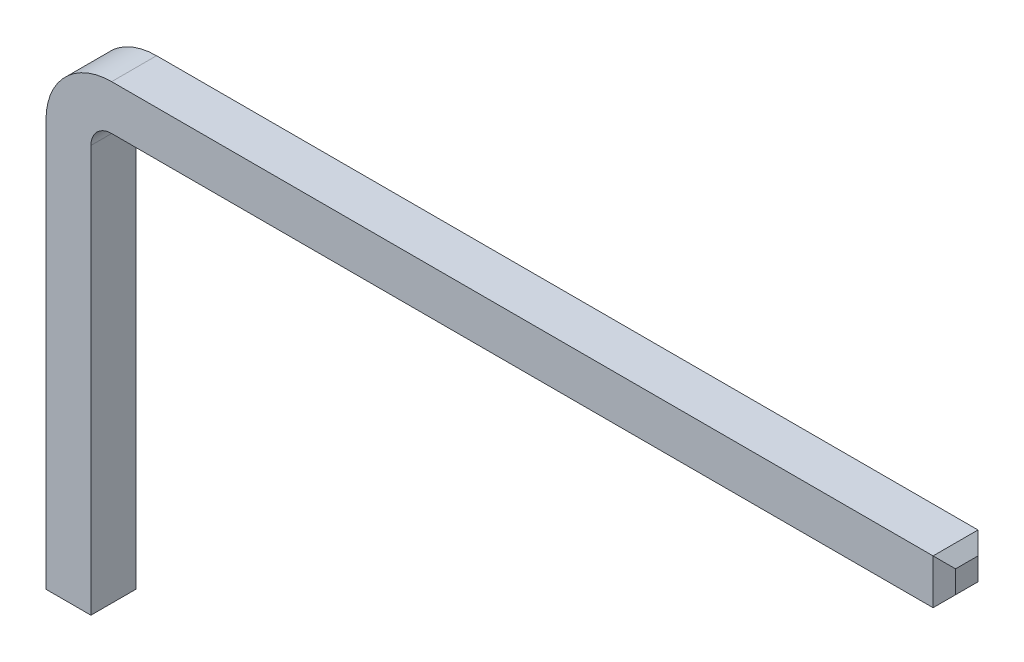
ISO-10303-21;
HEADER;
FILE_DESCRIPTION(('STEP AP214'),'2;1');
FILE_NAME('part.step','',(''),(''),'','','');
FILE_SCHEMA(('AUTOMOTIVE_DESIGN { 1 0 10303 214 1 1 1 1 }'));
ENDSEC;
DATA;
#1=APPLICATION_CONTEXT('core data for automotive mechanical design processes');
#2=APPLICATION_PROTOCOL_DEFINITION('international standard','automotive_design',2000,#1);
#3=PRODUCT_CONTEXT('',#1,'mechanical');
#4=PRODUCT('Part','Part','',(#3));
#5=PRODUCT_RELATED_PRODUCT_CATEGORY('part','',(#4));
#6=PRODUCT_DEFINITION_FORMATION('','',#4);
#7=PRODUCT_DEFINITION_CONTEXT('part definition',#1,'design');
#8=PRODUCT_DEFINITION('design','',#6,#7);
#9=PRODUCT_DEFINITION_SHAPE('','',#8);
#10=(LENGTH_UNIT() NAMED_UNIT(*) SI_UNIT(.MILLI.,.METRE.));
#11=(NAMED_UNIT(*) PLANE_ANGLE_UNIT() SI_UNIT($,.RADIAN.));
#12=(NAMED_UNIT(*) SI_UNIT($,.STERADIAN.) SOLID_ANGLE_UNIT());
#13=UNCERTAINTY_MEASURE_WITH_UNIT(LENGTH_MEASURE(1.E-05),#10,'distance_accuracy_value','');
#14=(GEOMETRIC_REPRESENTATION_CONTEXT(3) GLOBAL_UNCERTAINTY_ASSIGNED_CONTEXT((#13)) GLOBAL_UNIT_ASSIGNED_CONTEXT((#10,
#11,#12)) REPRESENTATION_CONTEXT('',''));
#15=CARTESIAN_POINT('',(0.,0.,0.));
#16=DIRECTION('',(0.,0.,1.));
#17=DIRECTION('',(1.,0.,0.));
#18=AXIS2_PLACEMENT_3D('',#15,#16,#17);
#19=CARTESIAN_POINT('',(0.,0.,0.65));
#20=DIRECTION('',(0.,1.,0.));
#21=DIRECTION('',(0.,0.,1.));
#22=AXIS2_PLACEMENT_3D('',#19,#20,#21);
#23=PLANE('',#22);
#24=DIRECTION('',(0.,0.,-1.));
#25=VECTOR('',#24,1.);
#26=CARTESIAN_POINT('',(0.162500000000004,0.,0.65));
#27=LINE('',#26,#25);
#28=CARTESIAN_POINT('',(0.162500000000004,0.,0.487499999999999));
#29=VERTEX_POINT('',#28);
#30=CARTESIAN_POINT('',(0.162500000000004,0.,0.162500000000001));
#31=VERTEX_POINT('',#30);
#32=EDGE_CURVE('E180',#29,#31,#27,.T.);
#33=ORIENTED_EDGE('',*,*,#32,.T.);
#34=DIRECTION('',(1.,0.,0.));
#35=VECTOR('',#34,1.);
#36=CARTESIAN_POINT('',(0.65,0.,0.162500000000001));
#37=LINE('',#36,#35);
#38=CARTESIAN_POINT('',(0.487499999999999,0.,0.162500000000001));
#39=VERTEX_POINT('',#38);
#40=EDGE_CURVE('E182',#31,#39,#37,.T.);
#41=ORIENTED_EDGE('',*,*,#40,.T.);
#42=DIRECTION('',(0.,0.,1.));
#43=VECTOR('',#42,1.);
#44=CARTESIAN_POINT('',(0.487499999999999,0.,0.65));
#45=LINE('',#44,#43);
#46=CARTESIAN_POINT('',(0.487499999999999,0.,0.487499999999999));
#47=VERTEX_POINT('',#46);
#48=EDGE_CURVE('E138',#39,#47,#45,.T.);
#49=ORIENTED_EDGE('',*,*,#48,.T.);
#50=DIRECTION('',(-1.,0.,0.));
#51=VECTOR('',#50,1.);
#52=CARTESIAN_POINT('',(0.,0.,0.487499999999999));
#53=LINE('',#52,#51);
#54=EDGE_CURVE('E178',#47,#29,#53,.T.);
#55=ORIENTED_EDGE('',*,*,#54,.T.);
#56=EDGE_LOOP('',(#33,#41,#49,#55));
#57=FACE_BOUND('',#56,.T.);
#58=ADVANCED_FACE('F31',(#57),#23,.F.);
#59=CARTESIAN_POINT('',(0.65,0.,0.65));
#60=DIRECTION('',(-1.,0.,0.));
#61=DIRECTION('',(0.,0.,1.));
#62=AXIS2_PLACEMENT_3D('',#59,#60,#61);
#63=PLANE('',#62);
#64=DIRECTION('',(0.,1.,0.));
#65=VECTOR('',#64,1.);
#66=CARTESIAN_POINT('',(0.65,0.,0.65));
#67=LINE('',#66,#65);
#68=CARTESIAN_POINT('',(0.65,0.1625,0.65));
#69=VERTEX_POINT('',#68);
#70=CARTESIAN_POINT('',(0.65,6.04999999999998,0.65));
#71=VERTEX_POINT('',#70);
#72=EDGE_CURVE('E157',#69,#71,#67,.T.);
#73=ORIENTED_EDGE('',*,*,#72,.F.);
#74=DIRECTION('',(0.,0.,-1.));
#75=VECTOR('',#74,1.);
#76=CARTESIAN_POINT('',(0.65,0.1625,0.65));
#77=LINE('',#76,#75);
#78=CARTESIAN_POINT('',(0.65,0.1625,0.));
#79=VERTEX_POINT('',#78);
#80=EDGE_CURVE('E125',#69,#79,#77,.T.);
#81=ORIENTED_EDGE('',*,*,#80,.T.);
#82=DIRECTION('',(0.,1.,0.));
#83=VECTOR('',#82,1.);
#84=CARTESIAN_POINT('',(0.65,0.,0.));
#85=LINE('',#84,#83);
#86=CARTESIAN_POINT('',(0.65,6.04999999999998,0.));
#87=VERTEX_POINT('',#86);
#88=EDGE_CURVE('E118',#79,#87,#85,.T.);
#89=ORIENTED_EDGE('',*,*,#88,.T.);
#90=DIRECTION('',(0.,0.,-1.));
#91=VECTOR('',#90,1.);
#92=CARTESIAN_POINT('',(0.65,6.04999999999998,0.65));
#93=LINE('',#92,#91);
#94=EDGE_CURVE('E122',#71,#87,#93,.T.);
#95=ORIENTED_EDGE('',*,*,#94,.F.);
#96=EDGE_LOOP('',(#73,#81,#89,#95));
#97=FACE_BOUND('',#96,.T.);
#98=ADVANCED_FACE('F121',(#97),#63,.F.);
#99=CARTESIAN_POINT('',(0.95,6.04999999999998,0.65));
#100=DIRECTION('',(0.,0.,-1.));
#101=DIRECTION('',(-1.,0.,0.));
#102=AXIS2_PLACEMENT_3D('',#99,#100,#101);
#103=CYLINDRICAL_SURFACE('',#102,0.3);
#104=CARTESIAN_POINT('',(0.95,6.04999999999998,0.));
#105=DIRECTION('',(0.,0.,-1.));
#106=DIRECTION('',(-1.,0.,0.));
#107=AXIS2_PLACEMENT_3D('',#104,#105,#106);
#108=CIRCLE('',#107,0.3);
#109=CARTESIAN_POINT('',(0.95,6.34999999999998,0.));
#110=VERTEX_POINT('',#109);
#111=EDGE_CURVE('E130',#87,#110,#108,.T.);
#112=ORIENTED_EDGE('',*,*,#111,.T.);
#113=DIRECTION('',(0.,0.,-1.));
#114=VECTOR('',#113,1.);
#115=CARTESIAN_POINT('',(0.95,6.34999999999998,0.65));
#116=LINE('',#115,#114);
#117=CARTESIAN_POINT('',(0.95,6.34999999999998,0.65));
#118=VERTEX_POINT('',#117);
#119=EDGE_CURVE('E139',#118,#110,#116,.T.);
#120=ORIENTED_EDGE('',*,*,#119,.F.);
#121=CARTESIAN_POINT('',(0.95,6.04999999999998,0.65));
#122=DIRECTION('',(0.,0.,-1.));
#123=DIRECTION('',(-1.,0.,0.));
#124=AXIS2_PLACEMENT_3D('',#121,#122,#123);
#125=CIRCLE('',#124,0.3);
#126=EDGE_CURVE('E137',#71,#118,#125,.T.);
#127=ORIENTED_EDGE('',*,*,#126,.F.);
#128=ORIENTED_EDGE('',*,*,#94,.T.);
#129=EDGE_LOOP('',(#112,#120,#127,#128));
#130=FACE_BOUND('',#129,.T.);
#131=ADVANCED_FACE('F134',(#130),#103,.F.);
#132=CARTESIAN_POINT('',(0.95,6.34999999999998,0.65));
#133=DIRECTION('',(0.,1.,0.));
#134=DIRECTION('',(-1.,0.,0.));
#135=AXIS2_PLACEMENT_3D('',#132,#133,#134);
#136=PLANE('',#135);
#137=DIRECTION('',(1.,0.,0.));
#138=VECTOR('',#137,1.);
#139=CARTESIAN_POINT('',(0.95,6.34999999999998,0.));
#140=LINE('',#139,#138);
#141=CARTESIAN_POINT('',(12.8375,6.35,0.));
#142=VERTEX_POINT('',#141);
#143=EDGE_CURVE('E145',#110,#142,#140,.T.);
#144=ORIENTED_EDGE('',*,*,#143,.T.);
#145=DIRECTION('',(0.,0.,1.));
#146=VECTOR('',#145,1.);
#147=CARTESIAN_POINT('',(12.8375,6.35,0.65));
#148=LINE('',#147,#146);
#149=CARTESIAN_POINT('',(12.8375,6.35,0.65));
#150=VERTEX_POINT('',#149);
#151=EDGE_CURVE('E38',#142,#150,#148,.T.);
#152=ORIENTED_EDGE('',*,*,#151,.T.);
#153=DIRECTION('',(1.,0.,0.));
#154=VECTOR('',#153,1.);
#155=CARTESIAN_POINT('',(0.95,6.34999999999998,0.65));
#156=LINE('',#155,#154);
#157=EDGE_CURVE('E160',#118,#150,#156,.T.);
#158=ORIENTED_EDGE('',*,*,#157,.F.);
#159=ORIENTED_EDGE('',*,*,#119,.T.);
#160=EDGE_LOOP('',(#144,#152,#158,#159));
#161=FACE_BOUND('',#160,.T.);
#162=ADVANCED_FACE('F204',(#161),#136,.F.);
#163=CARTESIAN_POINT('',(13.,7.,0.65));
#164=DIRECTION('',(-1.,0.,0.));
#165=DIRECTION('',(0.,0.,1.));
#166=AXIS2_PLACEMENT_3D('',#163,#164,#165);
#167=PLANE('',#166);
#168=DIRECTION('',(0.,0.,-1.));
#169=VECTOR('',#168,1.);
#170=CARTESIAN_POINT('',(13.,6.5125,0.65));
#171=LINE('',#170,#169);
#172=CARTESIAN_POINT('',(13.,6.5125,0.4875));
#173=VERTEX_POINT('',#172);
#174=CARTESIAN_POINT('',(13.,6.5125,0.1625));
#175=VERTEX_POINT('',#174);
#176=EDGE_CURVE('E45',#173,#175,#171,.T.);
#177=ORIENTED_EDGE('',*,*,#176,.T.);
#178=DIRECTION('',(0.,1.,0.));
#179=VECTOR('',#178,1.);
#180=CARTESIAN_POINT('',(13.,7.,0.1625));
#181=LINE('',#180,#179);
#182=CARTESIAN_POINT('',(13.,6.8375,0.1625));
#183=VERTEX_POINT('',#182);
#184=EDGE_CURVE('E200',#175,#183,#181,.T.);
#185=ORIENTED_EDGE('',*,*,#184,.T.);
#186=DIRECTION('',(0.,0.,1.));
#187=VECTOR('',#186,1.);
#188=CARTESIAN_POINT('',(13.,6.8375,0.65));
#189=LINE('',#188,#187);
#190=CARTESIAN_POINT('',(13.,6.8375,0.4875));
#191=VERTEX_POINT('',#190);
#192=EDGE_CURVE('E196',#183,#191,#189,.T.);
#193=ORIENTED_EDGE('',*,*,#192,.T.);
#194=DIRECTION('',(0.,-1.,0.));
#195=VECTOR('',#194,1.);
#196=CARTESIAN_POINT('',(13.,7.,0.4875));
#197=LINE('',#196,#195);
#198=EDGE_CURVE('E50',#191,#173,#197,.T.);
#199=ORIENTED_EDGE('',*,*,#198,.T.);
#200=EDGE_LOOP('',(#177,#185,#193,#199));
#201=FACE_BOUND('',#200,.T.);
#202=ADVANCED_FACE('F269',(#201),#167,.F.);
#203=CARTESIAN_POINT('',(0.95,7.,0.65));
#204=DIRECTION('',(0.,-1.,0.));
#205=DIRECTION('',(0.,0.,-1.));
#206=AXIS2_PLACEMENT_3D('',#203,#204,#205);
#207=PLANE('',#206);
#208=DIRECTION('',(-1.,0.,0.));
#209=VECTOR('',#208,1.);
#210=CARTESIAN_POINT('',(0.95,7.,0.65));
#211=LINE('',#210,#209);
#212=CARTESIAN_POINT('',(12.8375,7.,0.65));
#213=VERTEX_POINT('',#212);
#214=CARTESIAN_POINT('',(0.95,6.99999999999994,0.65));
#215=VERTEX_POINT('',#214);
#216=EDGE_CURVE('E163',#213,#215,#211,.T.);
#217=ORIENTED_EDGE('',*,*,#216,.F.);
#218=DIRECTION('',(0.,0.,-1.));
#219=VECTOR('',#218,1.);
#220=CARTESIAN_POINT('',(12.8375,7.,0.65));
#221=LINE('',#220,#219);
#222=CARTESIAN_POINT('',(12.8375,7.,0.));
#223=VERTEX_POINT('',#222);
#224=EDGE_CURVE('E11',#213,#223,#221,.T.);
#225=ORIENTED_EDGE('',*,*,#224,.T.);
#226=DIRECTION('',(-1.,0.,0.));
#227=VECTOR('',#226,1.);
#228=CARTESIAN_POINT('',(0.95,7.,0.));
#229=LINE('',#228,#227);
#230=CARTESIAN_POINT('',(0.95,6.99999999999994,0.));
#231=VERTEX_POINT('',#230);
#232=EDGE_CURVE('E147',#223,#231,#229,.T.);
#233=ORIENTED_EDGE('',*,*,#232,.T.);
#234=DIRECTION('',(0.,0.,-1.));
#235=VECTOR('',#234,1.);
#236=CARTESIAN_POINT('',(0.95,6.99999999999994,0.65));
#237=LINE('',#236,#235);
#238=EDGE_CURVE('E173',#215,#231,#237,.T.);
#239=ORIENTED_EDGE('',*,*,#238,.F.);
#240=EDGE_LOOP('',(#217,#225,#233,#239));
#241=FACE_BOUND('',#240,.T.);
#242=ADVANCED_FACE('F272',(#241),#207,.F.);
#243=CARTESIAN_POINT('',(0.95,6.04999999999998,0.65));
#244=DIRECTION('',(0.,0.,-1.));
#245=DIRECTION('',(-1.,0.,0.));
#246=AXIS2_PLACEMENT_3D('',#243,#244,#245);
#247=CYLINDRICAL_SURFACE('',#246,0.949999999999952);
#248=CARTESIAN_POINT('',(0.95,6.04999999999998,0.));
#249=DIRECTION('',(0.,0.,1.));
#250=DIRECTION('',(-1.,0.,0.));
#251=AXIS2_PLACEMENT_3D('',#248,#249,#250);
#252=CIRCLE('',#251,0.949999999999952);
#253=CARTESIAN_POINT('',(1.11022302462516E-13,6.04999999999999,0.));
#254=VERTEX_POINT('',#253);
#255=EDGE_CURVE('E152',#231,#254,#252,.T.);
#256=ORIENTED_EDGE('',*,*,#255,.T.);
#257=DIRECTION('',(0.,0.,-1.));
#258=VECTOR('',#257,1.);
#259=CARTESIAN_POINT('',(1.11022302462516E-13,6.04999999999999,0.65));
#260=LINE('',#259,#258);
#261=CARTESIAN_POINT('',(1.11022302462516E-13,6.04999999999999,0.65));
#262=VERTEX_POINT('',#261);
#263=EDGE_CURVE('E170',#262,#254,#260,.T.);
#264=ORIENTED_EDGE('',*,*,#263,.F.);
#265=CARTESIAN_POINT('',(0.95,6.04999999999998,0.65));
#266=DIRECTION('',(0.,0.,1.));
#267=DIRECTION('',(-1.,0.,0.));
#268=AXIS2_PLACEMENT_3D('',#265,#266,#267);
#269=CIRCLE('',#268,0.949999999999952);
#270=EDGE_CURVE('E165',#215,#262,#269,.T.);
#271=ORIENTED_EDGE('',*,*,#270,.F.);
#272=ORIENTED_EDGE('',*,*,#238,.T.);
#273=EDGE_LOOP('',(#256,#264,#271,#272));
#274=FACE_BOUND('',#273,.T.);
#275=ADVANCED_FACE('F275',(#274),#247,.T.);
#276=CARTESIAN_POINT('',(1.11022302462516E-13,6.04999999999999,0.65));
#277=DIRECTION('',(1.,0.,0.));
#278=DIRECTION('',(0.,1.,0.));
#279=AXIS2_PLACEMENT_3D('',#276,#277,#278);
#280=PLANE('',#279);
#281=DIRECTION('',(0.,-1.,0.));
#282=VECTOR('',#281,1.);
#283=CARTESIAN_POINT('',(1.11022302462516E-13,6.04999999999999,0.));
#284=LINE('',#283,#282);
#285=CARTESIAN_POINT('',(0.,0.162500000000003,0.));
#286=VERTEX_POINT('',#285);
#287=EDGE_CURVE('E154',#254,#286,#284,.T.);
#288=ORIENTED_EDGE('',*,*,#287,.T.);
#289=DIRECTION('',(0.,0.,1.));
#290=VECTOR('',#289,1.);
#291=CARTESIAN_POINT('',(0.,0.162500000000003,0.65));
#292=LINE('',#291,#290);
#293=CARTESIAN_POINT('',(0.,0.1625,0.65));
#294=VERTEX_POINT('',#293);
#295=EDGE_CURVE('E189',#286,#294,#292,.T.);
#296=ORIENTED_EDGE('',*,*,#295,.T.);
#297=DIRECTION('',(0.,-1.,0.));
#298=VECTOR('',#297,1.);
#299=CARTESIAN_POINT('',(1.11022302462516E-13,6.04999999999999,0.65));
#300=LINE('',#299,#298);
#301=EDGE_CURVE('E167',#262,#294,#300,.T.);
#302=ORIENTED_EDGE('',*,*,#301,.F.);
#303=ORIENTED_EDGE('',*,*,#263,.T.);
#304=EDGE_LOOP('',(#288,#296,#302,#303));
#305=FACE_BOUND('',#304,.T.);
#306=ADVANCED_FACE('F246',(#305),#280,.F.);
#307=CARTESIAN_POINT('',(0.95,6.04999999999998,0.65));
#308=DIRECTION('',(0.,0.,-1.));
#309=DIRECTION('',(-1.,0.,0.));
#310=AXIS2_PLACEMENT_3D('',#307,#308,#309);
#311=PLANE('',#310);
#312=ORIENTED_EDGE('',*,*,#301,.T.);
#313=DIRECTION('',(1.,0.,0.));
#314=VECTOR('',#313,1.);
#315=CARTESIAN_POINT('',(0.95,0.1625,0.65));
#316=LINE('',#315,#314);
#317=EDGE_CURVE('E193',#294,#69,#316,.T.);
#318=ORIENTED_EDGE('',*,*,#317,.T.);
#319=ORIENTED_EDGE('',*,*,#72,.T.);
#320=ORIENTED_EDGE('',*,*,#126,.T.);
#321=ORIENTED_EDGE('',*,*,#157,.T.);
#322=DIRECTION('',(0.,1.,0.));
#323=VECTOR('',#322,1.);
#324=CARTESIAN_POINT('',(12.8375,6.04999999999998,0.65));
#325=LINE('',#324,#323);
#326=EDGE_CURVE('E191',#150,#213,#325,.T.);
#327=ORIENTED_EDGE('',*,*,#326,.T.);
#328=ORIENTED_EDGE('',*,*,#216,.T.);
#329=ORIENTED_EDGE('',*,*,#270,.T.);
#330=EDGE_LOOP('',(#312,#318,#319,#320,#321,#327,#328,#329));
#331=FACE_BOUND('',#330,.T.);
#332=ADVANCED_FACE('F209',(#331),#311,.F.);
#333=CARTESIAN_POINT('',(0.95,6.04999999999998,0.));
#334=DIRECTION('',(0.,0.,-1.));
#335=DIRECTION('',(-1.,0.,0.));
#336=AXIS2_PLACEMENT_3D('',#333,#334,#335);
#337=PLANE('',#336);
#338=ORIENTED_EDGE('',*,*,#88,.F.);
#339=DIRECTION('',(-1.,0.,0.));
#340=VECTOR('',#339,1.);
#341=CARTESIAN_POINT('',(0.,0.1625,0.));
#342=LINE('',#341,#340);
#343=EDGE_CURVE('E187',#79,#286,#342,.T.);
#344=ORIENTED_EDGE('',*,*,#343,.T.);
#345=ORIENTED_EDGE('',*,*,#287,.F.);
#346=ORIENTED_EDGE('',*,*,#255,.F.);
#347=ORIENTED_EDGE('',*,*,#232,.F.);
#348=DIRECTION('',(0.,-1.,0.));
#349=VECTOR('',#348,1.);
#350=CARTESIAN_POINT('',(12.8375,6.35,0.));
#351=LINE('',#350,#349);
#352=EDGE_CURVE('E185',#223,#142,#351,.T.);
#353=ORIENTED_EDGE('',*,*,#352,.T.);
#354=ORIENTED_EDGE('',*,*,#143,.F.);
#355=ORIENTED_EDGE('',*,*,#111,.F.);
#356=EDGE_LOOP('',(#338,#344,#345,#346,#347,#353,#354,#355));
#357=FACE_BOUND('',#356,.T.);
#358=ADVANCED_FACE('F142',(#357),#337,.T.);
#359=CARTESIAN_POINT('',(0.95,0.1625,0.65));
#360=DIRECTION('',(0.,0.707106781186548,-0.707106781186547));
#361=DIRECTION('',(0.,0.707106781186547,0.707106781186548));
#362=AXIS2_PLACEMENT_3D('',#359,#360,#361);
#363=PLANE('',#362);
#364=DIRECTION('',(-0.577350269189627,-0.577350269189625,-0.577350269189626));
#365=VECTOR('',#364,1.);
#366=CARTESIAN_POINT('',(0.65,0.1625,0.65));
#367=LINE('',#366,#365);
#368=EDGE_CURVE('E228',#69,#47,#367,.T.);
#369=ORIENTED_EDGE('',*,*,#368,.F.);
#370=ORIENTED_EDGE('',*,*,#317,.F.);
#371=DIRECTION('',(0.57735026918962,-0.577350269189628,-0.577350269189629));
#372=VECTOR('',#371,1.);
#373=CARTESIAN_POINT('',(0.316666666666664,-0.154166666666663,0.333333333333337));
#374=LINE('',#373,#372);
#375=EDGE_CURVE('E131',#29,#294,#374,.F.);
#376=ORIENTED_EDGE('',*,*,#375,.F.);
#377=ORIENTED_EDGE('',*,*,#54,.F.);
#378=EDGE_LOOP('',(#369,#370,#376,#377));
#379=FACE_BOUND('',#378,.T.);
#380=ADVANCED_FACE('F241',(#379),#363,.F.);
#381=CARTESIAN_POINT('',(0.162500000000004,0.,0.65));
#382=DIRECTION('',(0.707106781186553,0.707106781186542,0.));
#383=DIRECTION('',(-0.707106781186542,0.707106781186553,0.));
#384=AXIS2_PLACEMENT_3D('',#381,#382,#383);
#385=PLANE('',#384);
#386=ORIENTED_EDGE('',*,*,#375,.T.);
#387=ORIENTED_EDGE('',*,*,#295,.F.);
#388=DIRECTION('',(-0.57735026918962,0.577350269189628,-0.577350269189629));
#389=VECTOR('',#388,1.);
#390=CARTESIAN_POINT('',(0.325000000000003,-0.162500000000001,0.325000000000002));
#391=LINE('',#390,#389);
#392=EDGE_CURVE('E221',#31,#286,#391,.T.);
#393=ORIENTED_EDGE('',*,*,#392,.F.);
#394=ORIENTED_EDGE('',*,*,#32,.F.);
#395=EDGE_LOOP('',(#386,#387,#393,#394));
#396=FACE_BOUND('',#395,.T.);
#397=ADVANCED_FACE('F235',(#396),#385,.F.);
#398=CARTESIAN_POINT('',(0.65,0.1625,0.65));
#399=DIRECTION('',(-0.707106781186546,0.707106781186549,0.));
#400=DIRECTION('',(-0.707106781186549,-0.707106781186546,0.));
#401=AXIS2_PLACEMENT_3D('',#398,#399,#400);
#402=PLANE('',#401);
#403=ORIENTED_EDGE('',*,*,#368,.T.);
#404=ORIENTED_EDGE('',*,*,#48,.F.);
#405=DIRECTION('',(-0.577350269189627,-0.577350269189625,0.577350269189626));
#406=VECTOR('',#405,1.);
#407=CARTESIAN_POINT('',(0.433333333333333,-0.0541666666666662,0.216666666666667));
#408=LINE('',#407,#406);
#409=EDGE_CURVE('E219',#79,#39,#408,.T.);
#410=ORIENTED_EDGE('',*,*,#409,.F.);
#411=ORIENTED_EDGE('',*,*,#80,.F.);
#412=EDGE_LOOP('',(#403,#404,#410,#411));
#413=FACE_BOUND('',#412,.T.);
#414=ADVANCED_FACE('F256',(#413),#402,.F.);
#415=CARTESIAN_POINT('',(0.,0.,0.162500000000001));
#416=DIRECTION('',(0.,-0.707106781186548,-0.707106781186547));
#417=DIRECTION('',(0.,0.707106781186547,-0.707106781186548));
#418=AXIS2_PLACEMENT_3D('',#415,#416,#417);
#419=PLANE('',#418);
#420=ORIENTED_EDGE('',*,*,#392,.T.);
#421=ORIENTED_EDGE('',*,*,#343,.F.);
#422=ORIENTED_EDGE('',*,*,#409,.T.);
#423=ORIENTED_EDGE('',*,*,#40,.F.);
#424=EDGE_LOOP('',(#420,#421,#422,#423));
#425=FACE_BOUND('',#424,.T.);
#426=ADVANCED_FACE('F252',(#425),#419,.T.);
#427=CARTESIAN_POINT('',(12.8375,6.04999999999998,0.65));
#428=DIRECTION('',(-0.707106781186546,0.,-0.707106781186549));
#429=DIRECTION('',(-0.707106781186549,0.,0.707106781186546));
#430=AXIS2_PLACEMENT_3D('',#427,#428,#429);
#431=PLANE('',#430);
#432=DIRECTION('',(0.577350269189628,-0.577350269189625,-0.577350269189625));
#433=VECTOR('',#432,1.);
#434=CARTESIAN_POINT('',(12.8375,7.,0.65));
#435=LINE('',#434,#433);
#436=EDGE_CURVE('E216',#213,#191,#435,.T.);
#437=ORIENTED_EDGE('',*,*,#436,.F.);
#438=ORIENTED_EDGE('',*,*,#326,.F.);
#439=DIRECTION('',(0.577350269189628,0.577350269189625,-0.577350269189625));
#440=VECTOR('',#439,1.);
#441=CARTESIAN_POINT('',(12.7375,6.24999999999999,0.750000000000005));
#442=LINE('',#441,#440);
#443=EDGE_CURVE('E214',#173,#150,#442,.F.);
#444=ORIENTED_EDGE('',*,*,#443,.F.);
#445=ORIENTED_EDGE('',*,*,#198,.F.);
#446=EDGE_LOOP('',(#437,#438,#444,#445));
#447=FACE_BOUND('',#446,.T.);
#448=ADVANCED_FACE('F213',(#447),#431,.F.);
#449=CARTESIAN_POINT('',(13.,6.5125,0.65));
#450=DIRECTION('',(-0.707106781186546,0.707106781186549,0.));
#451=DIRECTION('',(-0.707106781186549,-0.707106781186546,0.));
#452=AXIS2_PLACEMENT_3D('',#449,#450,#451);
#453=PLANE('',#452);
#454=ORIENTED_EDGE('',*,*,#443,.T.);
#455=ORIENTED_EDGE('',*,*,#151,.F.);
#456=DIRECTION('',(-0.577350269189628,-0.577350269189625,-0.577350269189625));
#457=VECTOR('',#456,1.);
#458=CARTESIAN_POINT('',(13.1625,6.675,0.325));
#459=LINE('',#458,#457);
#460=EDGE_CURVE('E223',#175,#142,#459,.T.);
#461=ORIENTED_EDGE('',*,*,#460,.F.);
#462=ORIENTED_EDGE('',*,*,#176,.F.);
#463=EDGE_LOOP('',(#454,#455,#461,#462));
#464=FACE_BOUND('',#463,.T.);
#465=ADVANCED_FACE('F218',(#464),#453,.F.);
#466=CARTESIAN_POINT('',(12.8375,7.,0.65));
#467=DIRECTION('',(-0.707106781186546,-0.707106781186549,0.));
#468=DIRECTION('',(0.707106781186549,-0.707106781186546,0.));
#469=AXIS2_PLACEMENT_3D('',#466,#467,#468);
#470=PLANE('',#469);
#471=ORIENTED_EDGE('',*,*,#436,.T.);
#472=ORIENTED_EDGE('',*,*,#192,.F.);
#473=DIRECTION('',(0.577350269189628,-0.577350269189625,0.577350269189625));
#474=VECTOR('',#473,1.);
#475=CARTESIAN_POINT('',(13.0541666666667,6.78333333333333,0.216666666666666));
#476=LINE('',#475,#474);
#477=EDGE_CURVE('E310',#223,#183,#476,.T.);
#478=ORIENTED_EDGE('',*,*,#477,.F.);
#479=ORIENTED_EDGE('',*,*,#224,.F.);
#480=EDGE_LOOP('',(#471,#472,#478,#479));
#481=FACE_BOUND('',#480,.T.);
#482=ADVANCED_FACE('F298',(#481),#470,.F.);
#483=CARTESIAN_POINT('',(13.,7.,0.1625));
#484=DIRECTION('',(0.707106781186546,0.,-0.707106781186549));
#485=DIRECTION('',(-0.707106781186549,0.,-0.707106781186546));
#486=AXIS2_PLACEMENT_3D('',#483,#484,#485);
#487=PLANE('',#486);
#488=ORIENTED_EDGE('',*,*,#460,.T.);
#489=ORIENTED_EDGE('',*,*,#352,.F.);
#490=ORIENTED_EDGE('',*,*,#477,.T.);
#491=ORIENTED_EDGE('',*,*,#184,.F.);
#492=EDGE_LOOP('',(#488,#489,#490,#491));
#493=FACE_BOUND('',#492,.T.);
#494=ADVANCED_FACE('F301',(#493),#487,.T.);
#495=CLOSED_SHELL('',(#58,#98,#131,#162,#202,#242,#275,#306,#332,#358,#380,#397,#414,#426,#448,
#465,#482,#494));
#496=MANIFOLD_SOLID_BREP('B2',#495);
#497=ADVANCED_BREP_SHAPE_REPRESENTATION('',(#18,#496),#14);
#498=SHAPE_DEFINITION_REPRESENTATION(#9,#497);
ENDSEC;
END-ISO-10303-21;
